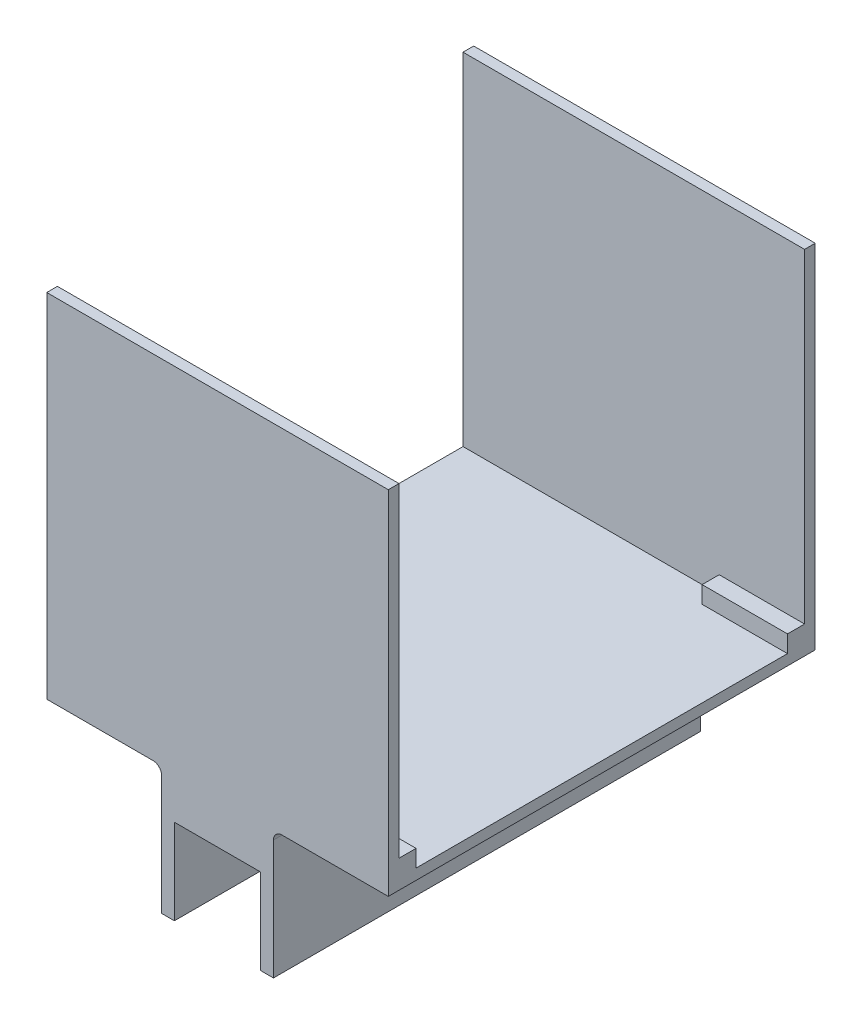
ISO-10303-21;
HEADER;
FILE_DESCRIPTION(('STEP AP214'),'2;1');
FILE_NAME('part.step','',(''),(''),'','','');
FILE_SCHEMA(('AUTOMOTIVE_DESIGN { 1 0 10303 214 1 1 1 1 }'));
ENDSEC;
DATA;
#1=APPLICATION_CONTEXT('core data for automotive mechanical design processes');
#2=APPLICATION_PROTOCOL_DEFINITION('international standard','automotive_design',2000,#1);
#3=PRODUCT_CONTEXT('',#1,'mechanical');
#4=PRODUCT('Part','Part','',(#3));
#5=PRODUCT_RELATED_PRODUCT_CATEGORY('part','',(#4));
#6=PRODUCT_DEFINITION_FORMATION('','',#4);
#7=PRODUCT_DEFINITION_CONTEXT('part definition',#1,'design');
#8=PRODUCT_DEFINITION('design','',#6,#7);
#9=PRODUCT_DEFINITION_SHAPE('','',#8);
#10=(LENGTH_UNIT() NAMED_UNIT(*) SI_UNIT(.MILLI.,.METRE.));
#11=(NAMED_UNIT(*) PLANE_ANGLE_UNIT() SI_UNIT($,.RADIAN.));
#12=(NAMED_UNIT(*) SI_UNIT($,.STERADIAN.) SOLID_ANGLE_UNIT());
#13=UNCERTAINTY_MEASURE_WITH_UNIT(LENGTH_MEASURE(1.E-05),#10,'distance_accuracy_value','');
#14=(GEOMETRIC_REPRESENTATION_CONTEXT(3) GLOBAL_UNCERTAINTY_ASSIGNED_CONTEXT((#13)) GLOBAL_UNIT_ASSIGNED_CONTEXT((#10,
#11,#12)) REPRESENTATION_CONTEXT('',''));
#15=CARTESIAN_POINT('',(0.,0.,0.));
#16=DIRECTION('',(0.,0.,1.));
#17=DIRECTION('',(1.,0.,0.));
#18=AXIS2_PLACEMENT_3D('',#15,#16,#17);
#19=CARTESIAN_POINT('',(0.,28.575,0.));
#20=DIRECTION('',(0.,-1.,0.));
#21=DIRECTION('',(0.,0.,-1.));
#22=AXIS2_PLACEMENT_3D('',#19,#20,#21);
#23=PLANE('',#22);
#24=DIRECTION('',(0.,0.,1.));
#25=VECTOR('',#24,1.);
#26=CARTESIAN_POINT('',(50.546,28.575,4.50850000000001));
#27=LINE('',#26,#25);
#28=CARTESIAN_POINT('',(50.546,28.575,3.17500000000001));
#29=VERTEX_POINT('',#28);
#30=CARTESIAN_POINT('',(50.546,28.575,4.50850000000001));
#31=VERTEX_POINT('',#30);
#32=EDGE_CURVE('E61',#29,#31,#27,.T.);
#33=ORIENTED_EDGE('',*,*,#32,.F.);
#34=DIRECTION('',(1.,0.,0.));
#35=VECTOR('',#34,1.);
#36=CARTESIAN_POINT('',(-50.8,28.575,3.17500000000001));
#37=LINE('',#36,#35);
#38=CARTESIAN_POINT('',(-50.8,28.575,3.17500000000001));
#39=VERTEX_POINT('',#38);
#40=EDGE_CURVE('E245',#39,#29,#37,.T.);
#41=ORIENTED_EDGE('',*,*,#40,.F.);
#42=DIRECTION('',(0.,0.,1.));
#43=VECTOR('',#42,1.);
#44=CARTESIAN_POINT('',(-50.8,28.575,127.));
#45=LINE('',#44,#43);
#46=CARTESIAN_POINT('',(-50.8,28.575,123.825));
#47=VERTEX_POINT('',#46);
#48=EDGE_CURVE('E395',#39,#47,#45,.T.);
#49=ORIENTED_EDGE('',*,*,#48,.T.);
#50=DIRECTION('',(-1.,0.,0.));
#51=VECTOR('',#50,1.);
#52=CARTESIAN_POINT('',(-50.8,28.575,123.825));
#53=LINE('',#52,#51);
#54=CARTESIAN_POINT('',(50.546,28.575,123.825));
#55=VERTEX_POINT('',#54);
#56=EDGE_CURVE('E355',#55,#47,#53,.T.);
#57=ORIENTED_EDGE('',*,*,#56,.F.);
#58=DIRECTION('',(0.,0.,-1.));
#59=VECTOR('',#58,1.);
#60=CARTESIAN_POINT('',(50.546,28.575,123.825));
#61=LINE('',#60,#59);
#62=CARTESIAN_POINT('',(50.546,28.575,122.4915));
#63=VERTEX_POINT('',#62);
#64=EDGE_CURVE('E296',#55,#63,#61,.T.);
#65=ORIENTED_EDGE('',*,*,#64,.T.);
#66=DIRECTION('',(1.,0.,0.));
#67=VECTOR('',#66,1.);
#68=CARTESIAN_POINT('',(25.4,28.575,122.4915));
#69=LINE('',#68,#67);
#70=CARTESIAN_POINT('',(25.4,28.575,122.4915));
#71=VERTEX_POINT('',#70);
#72=EDGE_CURVE('E313',#71,#63,#69,.T.);
#73=ORIENTED_EDGE('',*,*,#72,.F.);
#74=DIRECTION('',(0.,0.,1.));
#75=VECTOR('',#74,1.);
#76=CARTESIAN_POINT('',(25.4,28.575,0.));
#77=LINE('',#76,#75);
#78=CARTESIAN_POINT('',(25.4,28.575,118.745));
#79=VERTEX_POINT('',#78);
#80=EDGE_CURVE('E341',#79,#71,#77,.T.);
#81=ORIENTED_EDGE('',*,*,#80,.F.);
#82=DIRECTION('',(1.,0.,0.));
#83=VECTOR('',#82,1.);
#84=CARTESIAN_POINT('',(25.4,28.575,118.745));
#85=LINE('',#84,#83);
#86=CARTESIAN_POINT('',(50.8,28.575,118.745));
#87=VERTEX_POINT('',#86);
#88=EDGE_CURVE('E328',#79,#87,#85,.T.);
#89=ORIENTED_EDGE('',*,*,#88,.T.);
#90=DIRECTION('',(0.,0.,-1.));
#91=VECTOR('',#90,1.);
#92=CARTESIAN_POINT('',(50.8,28.575,127.));
#93=LINE('',#92,#91);
#94=CARTESIAN_POINT('',(50.8,28.575,8.25500000000001));
#95=VERTEX_POINT('',#94);
#96=EDGE_CURVE('E392',#87,#95,#93,.T.);
#97=ORIENTED_EDGE('',*,*,#96,.T.);
#98=DIRECTION('',(1.,0.,0.));
#99=VECTOR('',#98,1.);
#100=CARTESIAN_POINT('',(18.2157951031447,28.575,8.25500000000001));
#101=LINE('',#100,#99);
#102=CARTESIAN_POINT('',(25.4,28.575,8.25500000000001));
#103=VERTEX_POINT('',#102);
#104=EDGE_CURVE('E280',#103,#95,#101,.T.);
#105=ORIENTED_EDGE('',*,*,#104,.F.);
#106=DIRECTION('',(0.,0.,-1.));
#107=VECTOR('',#106,1.);
#108=CARTESIAN_POINT('',(25.4,28.575,0.));
#109=LINE('',#108,#107);
#110=CARTESIAN_POINT('',(25.4,28.575,4.50850000000001));
#111=VERTEX_POINT('',#110);
#112=EDGE_CURVE('E265',#103,#111,#109,.T.);
#113=ORIENTED_EDGE('',*,*,#112,.T.);
#114=DIRECTION('',(1.,0.,0.));
#115=VECTOR('',#114,1.);
#116=CARTESIAN_POINT('',(18.2157951031447,28.575,4.50850000000001));
#117=LINE('',#116,#115);
#118=EDGE_CURVE('E277',#111,#31,#117,.T.);
#119=ORIENTED_EDGE('',*,*,#118,.T.);
#120=EDGE_LOOP('',(#33,#41,#49,#57,#65,#73,#81,#89,#97,#105,#113,#119));
#121=FACE_BOUND('',#120,.T.);
#122=ADVANCED_FACE('F45',(#121),#23,.F.);
#123=CARTESIAN_POINT('',(-50.8,130.175,3.17500000000001));
#124=DIRECTION('',(0.,0.,-1.));
#125=DIRECTION('',(-1.,0.,0.));
#126=AXIS2_PLACEMENT_3D('',#123,#124,#125);
#127=PLANE('',#126);
#128=DIRECTION('',(0.,-1.,0.));
#129=VECTOR('',#128,1.);
#130=CARTESIAN_POINT('',(50.546,29.9085,3.17500000000001));
#131=LINE('',#130,#129);
#132=CARTESIAN_POINT('',(50.546,29.9085,3.17500000000001));
#133=VERTEX_POINT('',#132);
#134=EDGE_CURVE('E242',#133,#29,#131,.T.);
#135=ORIENTED_EDGE('',*,*,#134,.F.);
#136=DIRECTION('',(1.,0.,0.));
#137=VECTOR('',#136,1.);
#138=CARTESIAN_POINT('',(18.2157951031447,29.9085,3.17500000000001));
#139=LINE('',#138,#137);
#140=CARTESIAN_POINT('',(25.4,29.9085,3.17500000000001));
#141=VERTEX_POINT('',#140);
#142=EDGE_CURVE('E230',#141,#133,#139,.T.);
#143=ORIENTED_EDGE('',*,*,#142,.F.);
#144=DIRECTION('',(0.,1.,0.));
#145=VECTOR('',#144,1.);
#146=CARTESIAN_POINT('',(25.4,0.,3.17500000000001));
#147=LINE('',#146,#145);
#148=CARTESIAN_POINT('',(25.4,33.655,3.17500000000001));
#149=VERTEX_POINT('',#148);
#150=EDGE_CURVE('E261',#141,#149,#147,.T.);
#151=ORIENTED_EDGE('',*,*,#150,.T.);
#152=DIRECTION('',(1.,0.,0.));
#153=VECTOR('',#152,1.);
#154=CARTESIAN_POINT('',(18.2157951031447,33.655,3.17500000000001));
#155=LINE('',#154,#153);
#156=CARTESIAN_POINT('',(50.8,33.655,3.17500000000001));
#157=VERTEX_POINT('',#156);
#158=EDGE_CURVE('E238',#149,#157,#155,.T.);
#159=ORIENTED_EDGE('',*,*,#158,.T.);
#160=DIRECTION('',(0.,-1.,0.));
#161=VECTOR('',#160,1.);
#162=CARTESIAN_POINT('',(50.8,130.175,3.17500000000001));
#163=LINE('',#162,#161);
#164=CARTESIAN_POINT('',(50.8,130.175,3.17500000000001));
#165=VERTEX_POINT('',#164);
#166=EDGE_CURVE('E348',#165,#157,#163,.T.);
#167=ORIENTED_EDGE('',*,*,#166,.F.);
#168=DIRECTION('',(1.,0.,0.));
#169=VECTOR('',#168,1.);
#170=CARTESIAN_POINT('',(-50.8,130.175,3.17500000000001));
#171=LINE('',#170,#169);
#172=CARTESIAN_POINT('',(-50.8,130.175,3.17500000000001));
#173=VERTEX_POINT('',#172);
#174=EDGE_CURVE('E363',#173,#165,#171,.T.);
#175=ORIENTED_EDGE('',*,*,#174,.F.);
#176=DIRECTION('',(0.,-1.,0.));
#177=VECTOR('',#176,1.);
#178=CARTESIAN_POINT('',(-50.8,130.175,3.17500000000001));
#179=LINE('',#178,#177);
#180=EDGE_CURVE('E345',#173,#39,#179,.T.);
#181=ORIENTED_EDGE('',*,*,#180,.T.);
#182=ORIENTED_EDGE('',*,*,#40,.T.);
#183=EDGE_LOOP('',(#135,#143,#151,#159,#167,#175,#181,#182));
#184=FACE_BOUND('',#183,.T.);
#185=ADVANCED_FACE('F243',(#184),#127,.F.);
#186=CARTESIAN_POINT('',(18.2157951031447,29.9085,4.50850000000001));
#187=DIRECTION('',(1.,0.,0.));
#188=DIRECTION('',(0.,0.,-1.));
#189=AXIS2_PLACEMENT_3D('',#186,#187,#188);
#190=CYLINDRICAL_SURFACE('',#189,1.3335);
#191=CARTESIAN_POINT('',(50.546,29.9085,4.50850000000001));
#192=DIRECTION('',(1.,0.,0.));
#193=DIRECTION('',(0.,0.,-1.));
#194=AXIS2_PLACEMENT_3D('',#191,#192,#193);
#195=CIRCLE('',#194,1.3335);
#196=EDGE_CURVE('E69',#31,#133,#195,.F.);
#197=ORIENTED_EDGE('',*,*,#196,.F.);
#198=ORIENTED_EDGE('',*,*,#118,.F.);
#199=CARTESIAN_POINT('',(25.4,29.9085,4.50850000000001));
#200=DIRECTION('',(1.,0.,0.));
#201=DIRECTION('',(0.,0.,-1.));
#202=AXIS2_PLACEMENT_3D('',#199,#200,#201);
#203=CIRCLE('',#202,1.3335);
#204=EDGE_CURVE('E234',#111,#141,#203,.F.);
#205=ORIENTED_EDGE('',*,*,#204,.T.);
#206=ORIENTED_EDGE('',*,*,#142,.T.);
#207=EDGE_LOOP('',(#197,#198,#205,#206));
#208=FACE_BOUND('',#207,.T.);
#209=ADVANCED_FACE('F232',(#208),#190,.F.);
#210=CARTESIAN_POINT('',(-50.8,130.175,123.825));
#211=DIRECTION('',(0.,0.,1.));
#212=DIRECTION('',(1.,0.,0.));
#213=AXIS2_PLACEMENT_3D('',#210,#211,#212);
#214=PLANE('',#213);
#215=DIRECTION('',(0.,-1.,0.));
#216=VECTOR('',#215,1.);
#217=CARTESIAN_POINT('',(50.546,29.9085,123.825));
#218=LINE('',#217,#216);
#219=CARTESIAN_POINT('',(50.546,29.9085,123.825));
#220=VERTEX_POINT('',#219);
#221=EDGE_CURVE('E293',#220,#55,#218,.T.);
#222=ORIENTED_EDGE('',*,*,#221,.T.);
#223=ORIENTED_EDGE('',*,*,#56,.T.);
#224=DIRECTION('',(0.,-1.,0.));
#225=VECTOR('',#224,1.);
#226=CARTESIAN_POINT('',(-50.8,130.175,123.825));
#227=LINE('',#226,#225);
#228=CARTESIAN_POINT('',(-50.8,130.175,123.825));
#229=VERTEX_POINT('',#228);
#230=EDGE_CURVE('E382',#229,#47,#227,.T.);
#231=ORIENTED_EDGE('',*,*,#230,.F.);
#232=DIRECTION('',(-1.,0.,0.));
#233=VECTOR('',#232,1.);
#234=CARTESIAN_POINT('',(-50.8,130.175,123.825));
#235=LINE('',#234,#233);
#236=CARTESIAN_POINT('',(50.8,130.175,123.825));
#237=VERTEX_POINT('',#236);
#238=EDGE_CURVE('E379',#237,#229,#235,.T.);
#239=ORIENTED_EDGE('',*,*,#238,.F.);
#240=DIRECTION('',(0.,-1.,0.));
#241=VECTOR('',#240,1.);
#242=CARTESIAN_POINT('',(50.8,130.175,123.825));
#243=LINE('',#242,#241);
#244=CARTESIAN_POINT('',(50.8,33.655,123.825));
#245=VERTEX_POINT('',#244);
#246=EDGE_CURVE('E388',#237,#245,#243,.T.);
#247=ORIENTED_EDGE('',*,*,#246,.T.);
#248=DIRECTION('',(1.,0.,0.));
#249=VECTOR('',#248,1.);
#250=CARTESIAN_POINT('',(25.4,33.655,123.825));
#251=LINE('',#250,#249);
#252=CARTESIAN_POINT('',(25.4,33.655,123.825));
#253=VERTEX_POINT('',#252);
#254=EDGE_CURVE('E320',#253,#245,#251,.T.);
#255=ORIENTED_EDGE('',*,*,#254,.F.);
#256=DIRECTION('',(0.,1.,0.));
#257=VECTOR('',#256,1.);
#258=CARTESIAN_POINT('',(25.4,130.175,123.825));
#259=LINE('',#258,#257);
#260=CARTESIAN_POINT('',(25.4,29.9085,123.825));
#261=VERTEX_POINT('',#260);
#262=EDGE_CURVE('E324',#261,#253,#259,.T.);
#263=ORIENTED_EDGE('',*,*,#262,.F.);
#264=DIRECTION('',(1.,0.,0.));
#265=VECTOR('',#264,1.);
#266=CARTESIAN_POINT('',(25.4,29.9085,123.825));
#267=LINE('',#266,#265);
#268=EDGE_CURVE('E332',#261,#220,#267,.T.);
#269=ORIENTED_EDGE('',*,*,#268,.T.);
#270=EDGE_LOOP('',(#222,#223,#231,#239,#247,#255,#263,#269));
#271=FACE_BOUND('',#270,.T.);
#272=ADVANCED_FACE('F618',(#271),#214,.F.);
#273=CARTESIAN_POINT('',(25.4,29.9085,122.4915));
#274=DIRECTION('',(1.,0.,0.));
#275=DIRECTION('',(0.,0.,-1.));
#276=AXIS2_PLACEMENT_3D('',#273,#274,#275);
#277=CYLINDRICAL_SURFACE('',#276,1.3335);
#278=CARTESIAN_POINT('',(50.546,29.9085,122.4915));
#279=DIRECTION('',(1.,0.,0.));
#280=DIRECTION('',(0.,0.,-1.));
#281=AXIS2_PLACEMENT_3D('',#278,#279,#280);
#282=CIRCLE('',#281,1.3335);
#283=EDGE_CURVE('E270',#63,#220,#282,.T.);
#284=ORIENTED_EDGE('',*,*,#283,.T.);
#285=ORIENTED_EDGE('',*,*,#268,.F.);
#286=CARTESIAN_POINT('',(25.4,29.9085,122.4915));
#287=DIRECTION('',(1.,0.,0.));
#288=DIRECTION('',(0.,0.,-1.));
#289=AXIS2_PLACEMENT_3D('',#286,#287,#288);
#290=CIRCLE('',#289,1.3335);
#291=EDGE_CURVE('E301',#71,#261,#290,.T.);
#292=ORIENTED_EDGE('',*,*,#291,.F.);
#293=ORIENTED_EDGE('',*,*,#72,.T.);
#294=EDGE_LOOP('',(#284,#285,#292,#293));
#295=FACE_BOUND('',#294,.T.);
#296=ADVANCED_FACE('F627',(#295),#277,.F.);
#297=CARTESIAN_POINT('',(12.827,-12.7,127.));
#298=DIRECTION('',(1.,0.,0.));
#299=DIRECTION('',(0.,0.,-1.));
#300=AXIS2_PLACEMENT_3D('',#297,#298,#299);
#301=PLANE('',#300);
#302=DIRECTION('',(0.,-1.,0.));
#303=VECTOR('',#302,1.);
#304=CARTESIAN_POINT('',(12.827,-12.7,0.));
#305=LINE('',#304,#303);
#306=CARTESIAN_POINT('',(12.827,12.7,0.));
#307=VERTEX_POINT('',#306);
#308=CARTESIAN_POINT('',(12.827,-12.7,0.));
#309=VERTEX_POINT('',#308);
#310=EDGE_CURVE('E430',#307,#309,#305,.T.);
#311=ORIENTED_EDGE('',*,*,#310,.T.);
#312=DIRECTION('',(0.,0.,-1.));
#313=VECTOR('',#312,1.);
#314=CARTESIAN_POINT('',(12.827,-12.7,127.));
#315=LINE('',#314,#313);
#316=CARTESIAN_POINT('',(12.827,-12.7,127.));
#317=VERTEX_POINT('',#316);
#318=EDGE_CURVE('E496',#317,#309,#315,.T.);
#319=ORIENTED_EDGE('',*,*,#318,.F.);
#320=DIRECTION('',(0.,-1.,0.));
#321=VECTOR('',#320,1.);
#322=CARTESIAN_POINT('',(12.827,-12.7,127.));
#323=LINE('',#322,#321);
#324=CARTESIAN_POINT('',(12.827,12.7,127.));
#325=VERTEX_POINT('',#324);
#326=EDGE_CURVE('E431',#325,#317,#323,.T.);
#327=ORIENTED_EDGE('',*,*,#326,.F.);
#328=DIRECTION('',(0.,0.,-1.));
#329=VECTOR('',#328,1.);
#330=CARTESIAN_POINT('',(12.827,12.7,127.));
#331=LINE('',#330,#329);
#332=EDGE_CURVE('E455',#325,#307,#331,.T.);
#333=ORIENTED_EDGE('',*,*,#332,.T.);
#334=EDGE_LOOP('',(#311,#319,#327,#333));
#335=FACE_BOUND('',#334,.T.);
#336=ADVANCED_FACE('F560',(#335),#301,.F.);
#337=CARTESIAN_POINT('',(12.827,-12.7,127.));
#338=DIRECTION('',(0.,1.,0.));
#339=DIRECTION('',(0.,0.,1.));
#340=AXIS2_PLACEMENT_3D('',#337,#338,#339);
#341=PLANE('',#340);
#342=DIRECTION('',(1.,0.,0.));
#343=VECTOR('',#342,1.);
#344=CARTESIAN_POINT('',(12.827,-12.7,0.));
#345=LINE('',#344,#343);
#346=CARTESIAN_POINT('',(16.637,-12.7,0.));
#347=VERTEX_POINT('',#346);
#348=EDGE_CURVE('E459',#309,#347,#345,.T.);
#349=ORIENTED_EDGE('',*,*,#348,.T.);
#350=DIRECTION('',(0.,0.,-1.));
#351=VECTOR('',#350,1.);
#352=CARTESIAN_POINT('',(16.637,-12.7,127.));
#353=LINE('',#352,#351);
#354=CARTESIAN_POINT('',(16.637,-12.7,127.));
#355=VERTEX_POINT('',#354);
#356=EDGE_CURVE('E492',#355,#347,#353,.T.);
#357=ORIENTED_EDGE('',*,*,#356,.F.);
#358=DIRECTION('',(1.,0.,0.));
#359=VECTOR('',#358,1.);
#360=CARTESIAN_POINT('',(12.827,-12.7,127.));
#361=LINE('',#360,#359);
#362=EDGE_CURVE('E435',#317,#355,#361,.T.);
#363=ORIENTED_EDGE('',*,*,#362,.F.);
#364=ORIENTED_EDGE('',*,*,#318,.T.);
#365=EDGE_LOOP('',(#349,#357,#363,#364));
#366=FACE_BOUND('',#365,.T.);
#367=ADVANCED_FACE('F565',(#366),#341,.F.);
#368=CARTESIAN_POINT('',(16.637,25.4,127.));
#369=DIRECTION('',(-1.,0.,0.));
#370=DIRECTION('',(0.,-1.,0.));
#371=AXIS2_PLACEMENT_3D('',#368,#369,#370);
#372=PLANE('',#371);
#373=DIRECTION('',(0.,1.,0.));
#374=VECTOR('',#373,1.);
#375=CARTESIAN_POINT('',(16.637,25.4,0.));
#376=LINE('',#375,#374);
#377=CARTESIAN_POINT('',(16.637,22.86,0.));
#378=VERTEX_POINT('',#377);
#379=EDGE_CURVE('E462',#347,#378,#376,.T.);
#380=ORIENTED_EDGE('',*,*,#379,.T.);
#381=DIRECTION('',(0.,0.,-1.));
#382=VECTOR('',#381,1.);
#383=CARTESIAN_POINT('',(16.637,22.86,127.));
#384=LINE('',#383,#382);
#385=CARTESIAN_POINT('',(16.637,22.86,127.));
#386=VERTEX_POINT('',#385);
#387=EDGE_CURVE('E504',#378,#386,#384,.F.);
#388=ORIENTED_EDGE('',*,*,#387,.T.);
#389=DIRECTION('',(0.,1.,0.));
#390=VECTOR('',#389,1.);
#391=CARTESIAN_POINT('',(16.637,25.4,127.));
#392=LINE('',#391,#390);
#393=EDGE_CURVE('E439',#355,#386,#392,.T.);
#394=ORIENTED_EDGE('',*,*,#393,.F.);
#395=ORIENTED_EDGE('',*,*,#356,.T.);
#396=EDGE_LOOP('',(#380,#388,#394,#395));
#397=FACE_BOUND('',#396,.T.);
#398=ADVANCED_FACE('F568',(#397),#372,.F.);
#399=CARTESIAN_POINT('',(-16.637,-12.7,127.));
#400=DIRECTION('',(1.,0.,0.));
#401=DIRECTION('',(0.,0.,-1.));
#402=AXIS2_PLACEMENT_3D('',#399,#400,#401);
#403=PLANE('',#402);
#404=DIRECTION('',(0.,-1.,0.));
#405=VECTOR('',#404,1.);
#406=CARTESIAN_POINT('',(-16.637,-12.7,127.));
#407=LINE('',#406,#405);
#408=CARTESIAN_POINT('',(-16.637,22.86,127.));
#409=VERTEX_POINT('',#408);
#410=CARTESIAN_POINT('',(-16.637,-12.7,127.));
#411=VERTEX_POINT('',#410);
#412=EDGE_CURVE('E443',#409,#411,#407,.T.);
#413=ORIENTED_EDGE('',*,*,#412,.F.);
#414=DIRECTION('',(0.,0.,-1.));
#415=VECTOR('',#414,1.);
#416=CARTESIAN_POINT('',(-16.637,22.86,127.));
#417=LINE('',#416,#415);
#418=CARTESIAN_POINT('',(-16.637,22.86,0.));
#419=VERTEX_POINT('',#418);
#420=EDGE_CURVE('E507',#409,#419,#417,.T.);
#421=ORIENTED_EDGE('',*,*,#420,.T.);
#422=DIRECTION('',(0.,-1.,0.));
#423=VECTOR('',#422,1.);
#424=CARTESIAN_POINT('',(-16.637,-12.7,0.));
#425=LINE('',#424,#423);
#426=CARTESIAN_POINT('',(-16.637,-12.7,0.));
#427=VERTEX_POINT('',#426);
#428=EDGE_CURVE('E466',#419,#427,#425,.T.);
#429=ORIENTED_EDGE('',*,*,#428,.T.);
#430=DIRECTION('',(0.,0.,-1.));
#431=VECTOR('',#430,1.);
#432=CARTESIAN_POINT('',(-16.637,-12.7,127.));
#433=LINE('',#432,#431);
#434=EDGE_CURVE('E488',#411,#427,#433,.T.);
#435=ORIENTED_EDGE('',*,*,#434,.F.);
#436=EDGE_LOOP('',(#413,#421,#429,#435));
#437=FACE_BOUND('',#436,.T.);
#438=ADVANCED_FACE('F541',(#437),#403,.F.);
#439=CARTESIAN_POINT('',(-12.827,-12.7,127.));
#440=DIRECTION('',(0.,1.,0.));
#441=DIRECTION('',(0.,0.,1.));
#442=AXIS2_PLACEMENT_3D('',#439,#440,#441);
#443=PLANE('',#442);
#444=DIRECTION('',(1.,0.,0.));
#445=VECTOR('',#444,1.);
#446=CARTESIAN_POINT('',(-12.827,-12.7,0.));
#447=LINE('',#446,#445);
#448=CARTESIAN_POINT('',(-12.827,-12.7,0.));
#449=VERTEX_POINT('',#448);
#450=EDGE_CURVE('E469',#427,#449,#447,.T.);
#451=ORIENTED_EDGE('',*,*,#450,.T.);
#452=DIRECTION('',(0.,0.,-1.));
#453=VECTOR('',#452,1.);
#454=CARTESIAN_POINT('',(-12.827,-12.7,127.));
#455=LINE('',#454,#453);
#456=CARTESIAN_POINT('',(-12.827,-12.7,127.));
#457=VERTEX_POINT('',#456);
#458=EDGE_CURVE('E484',#457,#449,#455,.T.);
#459=ORIENTED_EDGE('',*,*,#458,.F.);
#460=DIRECTION('',(1.,0.,0.));
#461=VECTOR('',#460,1.);
#462=CARTESIAN_POINT('',(-12.827,-12.7,127.));
#463=LINE('',#462,#461);
#464=EDGE_CURVE('E446',#411,#457,#463,.T.);
#465=ORIENTED_EDGE('',*,*,#464,.F.);
#466=ORIENTED_EDGE('',*,*,#434,.T.);
#467=EDGE_LOOP('',(#451,#459,#465,#466));
#468=FACE_BOUND('',#467,.T.);
#469=ADVANCED_FACE('F545',(#468),#443,.F.);
#470=CARTESIAN_POINT('',(-12.827,-12.7,127.));
#471=DIRECTION('',(-1.,0.,0.));
#472=DIRECTION('',(0.,0.,1.));
#473=AXIS2_PLACEMENT_3D('',#470,#471,#472);
#474=PLANE('',#473);
#475=DIRECTION('',(0.,1.,0.));
#476=VECTOR('',#475,1.);
#477=CARTESIAN_POINT('',(-12.827,-12.7,0.));
#478=LINE('',#477,#476);
#479=CARTESIAN_POINT('',(-12.827,12.7,0.));
#480=VERTEX_POINT('',#479);
#481=EDGE_CURVE('E472',#449,#480,#478,.T.);
#482=ORIENTED_EDGE('',*,*,#481,.T.);
#483=DIRECTION('',(0.,0.,-1.));
#484=VECTOR('',#483,1.);
#485=CARTESIAN_POINT('',(-12.827,12.7,127.));
#486=LINE('',#485,#484);
#487=CARTESIAN_POINT('',(-12.827,12.7,127.));
#488=VERTEX_POINT('',#487);
#489=EDGE_CURVE('E480',#488,#480,#486,.T.);
#490=ORIENTED_EDGE('',*,*,#489,.F.);
#491=DIRECTION('',(0.,1.,0.));
#492=VECTOR('',#491,1.);
#493=CARTESIAN_POINT('',(-12.827,-12.7,127.));
#494=LINE('',#493,#492);
#495=EDGE_CURVE('E449',#457,#488,#494,.T.);
#496=ORIENTED_EDGE('',*,*,#495,.F.);
#497=ORIENTED_EDGE('',*,*,#458,.T.);
#498=EDGE_LOOP('',(#482,#490,#496,#497));
#499=FACE_BOUND('',#498,.T.);
#500=ADVANCED_FACE('F551',(#499),#474,.F.);
#501=CARTESIAN_POINT('',(-12.827,12.7,127.));
#502=DIRECTION('',(0.,1.,0.));
#503=DIRECTION('',(0.,0.,1.));
#504=AXIS2_PLACEMENT_3D('',#501,#502,#503);
#505=PLANE('',#504);
#506=DIRECTION('',(1.,0.,0.));
#507=VECTOR('',#506,1.);
#508=CARTESIAN_POINT('',(-12.827,12.7,0.));
#509=LINE('',#508,#507);
#510=EDGE_CURVE('E436',#480,#307,#509,.T.);
#511=ORIENTED_EDGE('',*,*,#510,.T.);
#512=ORIENTED_EDGE('',*,*,#332,.F.);
#513=DIRECTION('',(1.,0.,0.));
#514=VECTOR('',#513,1.);
#515=CARTESIAN_POINT('',(-12.827,12.7,127.));
#516=LINE('',#515,#514);
#517=EDGE_CURVE('E452',#488,#325,#516,.T.);
#518=ORIENTED_EDGE('',*,*,#517,.F.);
#519=ORIENTED_EDGE('',*,*,#489,.T.);
#520=EDGE_LOOP('',(#511,#512,#518,#519));
#521=FACE_BOUND('',#520,.T.);
#522=ADVANCED_FACE('F555',(#521),#505,.F.);
#523=CARTESIAN_POINT('',(0.,0.,127.));
#524=DIRECTION('',(0.,0.,-1.));
#525=DIRECTION('',(-1.,0.,0.));
#526=AXIS2_PLACEMENT_3D('',#523,#524,#525);
#527=PLANE('',#526);
#528=DIRECTION('',(0.,-1.,0.));
#529=VECTOR('',#528,1.);
#530=CARTESIAN_POINT('',(50.8,28.575,127.));
#531=LINE('',#530,#529);
#532=CARTESIAN_POINT('',(50.8,130.175,127.));
#533=VERTEX_POINT('',#532);
#534=CARTESIAN_POINT('',(50.8,25.4,127.));
#535=VERTEX_POINT('',#534);
#536=EDGE_CURVE('E400',#533,#535,#531,.T.);
#537=ORIENTED_EDGE('',*,*,#536,.F.);
#538=DIRECTION('',(1.,0.,0.));
#539=VECTOR('',#538,1.);
#540=CARTESIAN_POINT('',(-50.8,130.175,127.));
#541=LINE('',#540,#539);
#542=CARTESIAN_POINT('',(-50.8,130.175,127.));
#543=VERTEX_POINT('',#542);
#544=EDGE_CURVE('E373',#543,#533,#541,.T.);
#545=ORIENTED_EDGE('',*,*,#544,.F.);
#546=DIRECTION('',(0.,-1.,0.));
#547=VECTOR('',#546,1.);
#548=CARTESIAN_POINT('',(-50.8,28.575,127.));
#549=LINE('',#548,#547);
#550=CARTESIAN_POINT('',(-50.8,25.4,127.));
#551=VERTEX_POINT('',#550);
#552=EDGE_CURVE('E418',#543,#551,#549,.T.);
#553=ORIENTED_EDGE('',*,*,#552,.T.);
#554=DIRECTION('',(1.,0.,0.));
#555=VECTOR('',#554,1.);
#556=CARTESIAN_POINT('',(-50.8,25.4,127.));
#557=LINE('',#556,#555);
#558=CARTESIAN_POINT('',(-19.177,25.4,127.));
#559=VERTEX_POINT('',#558);
#560=EDGE_CURVE('E396',#551,#559,#557,.T.);
#561=ORIENTED_EDGE('',*,*,#560,.T.);
#562=CARTESIAN_POINT('',(-19.177,22.86,127.));
#563=DIRECTION('',(0.,0.,-1.));
#564=DIRECTION('',(-1.,0.,0.));
#565=AXIS2_PLACEMENT_3D('',#562,#563,#564);
#566=CIRCLE('',#565,2.54);
#567=EDGE_CURVE('E11',#559,#409,#566,.T.);
#568=ORIENTED_EDGE('',*,*,#567,.T.);
#569=ORIENTED_EDGE('',*,*,#412,.T.);
#570=ORIENTED_EDGE('',*,*,#464,.T.);
#571=ORIENTED_EDGE('',*,*,#495,.T.);
#572=ORIENTED_EDGE('',*,*,#517,.T.);
#573=ORIENTED_EDGE('',*,*,#326,.T.);
#574=ORIENTED_EDGE('',*,*,#362,.T.);
#575=ORIENTED_EDGE('',*,*,#393,.T.);
#576=CARTESIAN_POINT('',(19.177,22.86,127.));
#577=DIRECTION('',(0.,0.,-1.));
#578=DIRECTION('',(-1.,0.,0.));
#579=AXIS2_PLACEMENT_3D('',#576,#577,#578);
#580=CIRCLE('',#579,2.54);
#581=CARTESIAN_POINT('',(19.177,25.4,127.));
#582=VERTEX_POINT('',#581);
#583=EDGE_CURVE('E517',#386,#582,#580,.T.);
#584=ORIENTED_EDGE('',*,*,#583,.T.);
#585=EDGE_CURVE('E411',#582,#535,#557,.T.);
#586=ORIENTED_EDGE('',*,*,#585,.T.);
#587=EDGE_LOOP('',(#537,#545,#553,#561,#568,#569,#570,#571,#572,#573,#574,#575,#584,#586));
#588=FACE_BOUND('',#587,.T.);
#589=ADVANCED_FACE('F538',(#588),#527,.F.);
#590=CARTESIAN_POINT('',(0.,0.,0.));
#591=DIRECTION('',(0.,0.,-1.));
#592=DIRECTION('',(-1.,0.,0.));
#593=AXIS2_PLACEMENT_3D('',#590,#591,#592);
#594=PLANE('',#593);
#595=DIRECTION('',(-1.,0.,0.));
#596=VECTOR('',#595,1.);
#597=CARTESIAN_POINT('',(-50.8,25.4,0.));
#598=LINE('',#597,#596);
#599=CARTESIAN_POINT('',(50.8,25.4,0.));
#600=VERTEX_POINT('',#599);
#601=CARTESIAN_POINT('',(19.177,25.4,0.));
#602=VERTEX_POINT('',#601);
#603=EDGE_CURVE('E405',#600,#602,#598,.T.);
#604=ORIENTED_EDGE('',*,*,#603,.T.);
#605=CARTESIAN_POINT('',(19.177,22.86,0.));
#606=DIRECTION('',(0.,0.,-1.));
#607=DIRECTION('',(-1.,0.,0.));
#608=AXIS2_PLACEMENT_3D('',#605,#606,#607);
#609=CIRCLE('',#608,2.54);
#610=EDGE_CURVE('E514',#602,#378,#609,.F.);
#611=ORIENTED_EDGE('',*,*,#610,.T.);
#612=ORIENTED_EDGE('',*,*,#379,.F.);
#613=ORIENTED_EDGE('',*,*,#348,.F.);
#614=ORIENTED_EDGE('',*,*,#310,.F.);
#615=ORIENTED_EDGE('',*,*,#510,.F.);
#616=ORIENTED_EDGE('',*,*,#481,.F.);
#617=ORIENTED_EDGE('',*,*,#450,.F.);
#618=ORIENTED_EDGE('',*,*,#428,.F.);
#619=CARTESIAN_POINT('',(-19.177,22.86,0.));
#620=DIRECTION('',(0.,0.,-1.));
#621=DIRECTION('',(-1.,0.,0.));
#622=AXIS2_PLACEMENT_3D('',#619,#620,#621);
#623=CIRCLE('',#622,2.54);
#624=CARTESIAN_POINT('',(-19.177,25.4,0.));
#625=VERTEX_POINT('',#624);
#626=EDGE_CURVE('E54',#419,#625,#623,.F.);
#627=ORIENTED_EDGE('',*,*,#626,.T.);
#628=CARTESIAN_POINT('',(-50.8,25.4,0.));
#629=VERTEX_POINT('',#628);
#630=EDGE_CURVE('E404',#625,#629,#598,.T.);
#631=ORIENTED_EDGE('',*,*,#630,.T.);
#632=DIRECTION('',(0.,-1.,0.));
#633=VECTOR('',#632,1.);
#634=CARTESIAN_POINT('',(-50.8,28.575,0.));
#635=LINE('',#634,#633);
#636=CARTESIAN_POINT('',(-50.8,130.175,0.));
#637=VERTEX_POINT('',#636);
#638=EDGE_CURVE('E422',#637,#629,#635,.T.);
#639=ORIENTED_EDGE('',*,*,#638,.F.);
#640=DIRECTION('',(-1.,0.,0.));
#641=VECTOR('',#640,1.);
#642=CARTESIAN_POINT('',(-50.8,130.175,0.));
#643=LINE('',#642,#641);
#644=CARTESIAN_POINT('',(50.8,130.175,0.));
#645=VERTEX_POINT('',#644);
#646=EDGE_CURVE('E352',#645,#637,#643,.T.);
#647=ORIENTED_EDGE('',*,*,#646,.F.);
#648=DIRECTION('',(0.,-1.,0.));
#649=VECTOR('',#648,1.);
#650=CARTESIAN_POINT('',(50.8,28.575,0.));
#651=LINE('',#650,#649);
#652=EDGE_CURVE('E426',#645,#600,#651,.T.);
#653=ORIENTED_EDGE('',*,*,#652,.T.);
#654=EDGE_LOOP('',(#604,#611,#612,#613,#614,#615,#616,#617,#618,#627,#631,#639,#647,#653));
#655=FACE_BOUND('',#654,.T.);
#656=ADVANCED_FACE('F523',(#655),#594,.T.);
#657=CARTESIAN_POINT('',(0.,25.4,0.));
#658=DIRECTION('',(0.,-1.,0.));
#659=DIRECTION('',(0.,0.,-1.));
#660=AXIS2_PLACEMENT_3D('',#657,#658,#659);
#661=PLANE('',#660);
#662=ORIENTED_EDGE('',*,*,#630,.F.);
#663=DIRECTION('',(0.,0.,-1.));
#664=VECTOR('',#663,1.);
#665=CARTESIAN_POINT('',(-19.177,25.4,0.));
#666=LINE('',#665,#664);
#667=EDGE_CURVE('E511',#625,#559,#666,.F.);
#668=ORIENTED_EDGE('',*,*,#667,.T.);
#669=ORIENTED_EDGE('',*,*,#560,.F.);
#670=DIRECTION('',(0.,0.,1.));
#671=VECTOR('',#670,1.);
#672=CARTESIAN_POINT('',(-50.8,25.4,127.));
#673=LINE('',#672,#671);
#674=EDGE_CURVE('E408',#629,#551,#673,.T.);
#675=ORIENTED_EDGE('',*,*,#674,.F.);
#676=EDGE_LOOP('',(#662,#668,#669,#675));
#677=FACE_BOUND('',#676,.T.);
#678=ADVANCED_FACE('F531',(#677),#661,.T.);
#679=CARTESIAN_POINT('',(50.8,28.575,127.));
#680=DIRECTION('',(-1.,0.,0.));
#681=DIRECTION('',(0.,0.,1.));
#682=AXIS2_PLACEMENT_3D('',#679,#680,#681);
#683=PLANE('',#682);
#684=DIRECTION('',(0.,1.,0.));
#685=VECTOR('',#684,1.);
#686=CARTESIAN_POINT('',(50.8,0.,8.25500000000001));
#687=LINE('',#686,#685);
#688=CARTESIAN_POINT('',(50.8,33.655,8.25500000000001));
#689=VERTEX_POINT('',#688);
#690=EDGE_CURVE('E239',#95,#689,#687,.T.);
#691=ORIENTED_EDGE('',*,*,#690,.F.);
#692=ORIENTED_EDGE('',*,*,#96,.F.);
#693=DIRECTION('',(0.,1.,0.));
#694=VECTOR('',#693,1.);
#695=CARTESIAN_POINT('',(50.8,0.,118.745));
#696=LINE('',#695,#694);
#697=CARTESIAN_POINT('',(50.8,33.655,118.745));
#698=VERTEX_POINT('',#697);
#699=EDGE_CURVE('E300',#87,#698,#696,.T.);
#700=ORIENTED_EDGE('',*,*,#699,.T.);
#701=DIRECTION('',(0.,0.,-1.));
#702=VECTOR('',#701,1.);
#703=CARTESIAN_POINT('',(50.8,33.655,0.));
#704=LINE('',#703,#702);
#705=EDGE_CURVE('E306',#245,#698,#704,.T.);
#706=ORIENTED_EDGE('',*,*,#705,.F.);
#707=ORIENTED_EDGE('',*,*,#246,.F.);
#708=DIRECTION('',(0.,0.,-1.));
#709=VECTOR('',#708,1.);
#710=CARTESIAN_POINT('',(50.8,130.175,127.));
#711=LINE('',#710,#709);
#712=EDGE_CURVE('E376',#533,#237,#711,.T.);
#713=ORIENTED_EDGE('',*,*,#712,.F.);
#714=ORIENTED_EDGE('',*,*,#536,.T.);
#715=DIRECTION('',(0.,0.,-1.));
#716=VECTOR('',#715,1.);
#717=CARTESIAN_POINT('',(50.8,25.4,127.));
#718=LINE('',#717,#716);
#719=EDGE_CURVE('E391',#535,#600,#718,.T.);
#720=ORIENTED_EDGE('',*,*,#719,.T.);
#721=ORIENTED_EDGE('',*,*,#652,.F.);
#722=DIRECTION('',(0.,0.,-1.));
#723=VECTOR('',#722,1.);
#724=CARTESIAN_POINT('',(50.8,130.175,0.));
#725=LINE('',#724,#723);
#726=EDGE_CURVE('E359',#165,#645,#725,.T.);
#727=ORIENTED_EDGE('',*,*,#726,.F.);
#728=ORIENTED_EDGE('',*,*,#166,.T.);
#729=DIRECTION('',(0.,0.,1.));
#730=VECTOR('',#729,1.);
#731=CARTESIAN_POINT('',(50.8,33.655,0.));
#732=LINE('',#731,#730);
#733=EDGE_CURVE('E253',#157,#689,#732,.T.);
#734=ORIENTED_EDGE('',*,*,#733,.T.);
#735=EDGE_LOOP('',(#691,#692,#700,#706,#707,#713,#714,#720,#721,#727,#728,#734));
#736=FACE_BOUND('',#735,.T.);
#737=ADVANCED_FACE('F581',(#736),#683,.F.);
#738=CARTESIAN_POINT('',(-50.8,28.575,127.));
#739=DIRECTION('',(1.,0.,0.));
#740=DIRECTION('',(0.,0.,-1.));
#741=AXIS2_PLACEMENT_3D('',#738,#739,#740);
#742=PLANE('',#741);
#743=ORIENTED_EDGE('',*,*,#674,.T.);
#744=ORIENTED_EDGE('',*,*,#552,.F.);
#745=DIRECTION('',(0.,0.,1.));
#746=VECTOR('',#745,1.);
#747=CARTESIAN_POINT('',(-50.8,130.175,127.));
#748=LINE('',#747,#746);
#749=EDGE_CURVE('E369',#229,#543,#748,.T.);
#750=ORIENTED_EDGE('',*,*,#749,.F.);
#751=ORIENTED_EDGE('',*,*,#230,.T.);
#752=ORIENTED_EDGE('',*,*,#48,.F.);
#753=ORIENTED_EDGE('',*,*,#180,.F.);
#754=DIRECTION('',(0.,0.,1.));
#755=VECTOR('',#754,1.);
#756=CARTESIAN_POINT('',(-50.8,130.175,0.));
#757=LINE('',#756,#755);
#758=EDGE_CURVE('E356',#637,#173,#757,.T.);
#759=ORIENTED_EDGE('',*,*,#758,.F.);
#760=ORIENTED_EDGE('',*,*,#638,.T.);
#761=EDGE_LOOP('',(#743,#744,#750,#751,#752,#753,#759,#760));
#762=FACE_BOUND('',#761,.T.);
#763=ADVANCED_FACE('F592',(#762),#742,.F.);
#764=ORIENTED_EDGE('',*,*,#719,.F.);
#765=ORIENTED_EDGE('',*,*,#585,.F.);
#766=DIRECTION('',(0.,0.,-1.));
#767=VECTOR('',#766,1.);
#768=CARTESIAN_POINT('',(19.177,25.4,0.));
#769=LINE('',#768,#767);
#770=EDGE_CURVE('E500',#582,#602,#769,.T.);
#771=ORIENTED_EDGE('',*,*,#770,.T.);
#772=ORIENTED_EDGE('',*,*,#603,.F.);
#773=EDGE_LOOP('',(#764,#765,#771,#772));
#774=FACE_BOUND('',#773,.T.);
#775=ADVANCED_FACE('F577',(#774),#661,.T.);
#776=CARTESIAN_POINT('',(19.177,22.86,0.));
#777=DIRECTION('',(0.,0.,-1.));
#778=DIRECTION('',(-1.,0.,0.));
#779=AXIS2_PLACEMENT_3D('',#776,#777,#778);
#780=CYLINDRICAL_SURFACE('',#779,2.54);
#781=ORIENTED_EDGE('',*,*,#583,.F.);
#782=ORIENTED_EDGE('',*,*,#387,.F.);
#783=ORIENTED_EDGE('',*,*,#610,.F.);
#784=ORIENTED_EDGE('',*,*,#770,.F.);
#785=EDGE_LOOP('',(#781,#782,#783,#784));
#786=FACE_BOUND('',#785,.T.);
#787=ADVANCED_FACE('F572',(#786),#780,.F.);
#788=CARTESIAN_POINT('',(-19.177,22.86,127.));
#789=DIRECTION('',(0.,0.,-1.));
#790=DIRECTION('',(-1.,0.,0.));
#791=AXIS2_PLACEMENT_3D('',#788,#789,#790);
#792=CYLINDRICAL_SURFACE('',#791,2.54);
#793=ORIENTED_EDGE('',*,*,#567,.F.);
#794=ORIENTED_EDGE('',*,*,#667,.F.);
#795=ORIENTED_EDGE('',*,*,#626,.F.);
#796=ORIENTED_EDGE('',*,*,#420,.F.);
#797=EDGE_LOOP('',(#793,#794,#795,#796));
#798=FACE_BOUND('',#797,.T.);
#799=ADVANCED_FACE('F47',(#798),#792,.F.);
#800=CARTESIAN_POINT('',(0.,130.175,0.));
#801=DIRECTION('',(0.,-1.,0.));
#802=DIRECTION('',(0.,0.,-1.));
#803=AXIS2_PLACEMENT_3D('',#800,#801,#802);
#804=PLANE('',#803);
#805=ORIENTED_EDGE('',*,*,#238,.T.);
#806=ORIENTED_EDGE('',*,*,#749,.T.);
#807=ORIENTED_EDGE('',*,*,#544,.T.);
#808=ORIENTED_EDGE('',*,*,#712,.T.);
#809=EDGE_LOOP('',(#805,#806,#807,#808));
#810=FACE_BOUND('',#809,.T.);
#811=ADVANCED_FACE('F588',(#810),#804,.F.);
#812=CARTESIAN_POINT('',(0.,130.175,0.));
#813=DIRECTION('',(0.,1.,0.));
#814=DIRECTION('',(0.,0.,1.));
#815=AXIS2_PLACEMENT_3D('',#812,#813,#814);
#816=PLANE('',#815);
#817=ORIENTED_EDGE('',*,*,#646,.T.);
#818=ORIENTED_EDGE('',*,*,#758,.T.);
#819=ORIENTED_EDGE('',*,*,#174,.T.);
#820=ORIENTED_EDGE('',*,*,#726,.T.);
#821=EDGE_LOOP('',(#817,#818,#819,#820));
#822=FACE_BOUND('',#821,.T.);
#823=ADVANCED_FACE('F597',(#822),#816,.T.);
#824=CARTESIAN_POINT('',(25.4,0.,0.));
#825=DIRECTION('',(1.,0.,0.));
#826=DIRECTION('',(0.,0.,-1.));
#827=AXIS2_PLACEMENT_3D('',#824,#825,#826);
#828=PLANE('',#827);
#829=DIRECTION('',(0.,1.,0.));
#830=VECTOR('',#829,1.);
#831=CARTESIAN_POINT('',(25.4,0.,118.745));
#832=LINE('',#831,#830);
#833=CARTESIAN_POINT('',(25.4,33.655,118.745));
#834=VERTEX_POINT('',#833);
#835=EDGE_CURVE('E305',#79,#834,#832,.T.);
#836=ORIENTED_EDGE('',*,*,#835,.F.);
#837=ORIENTED_EDGE('',*,*,#80,.T.);
#838=ORIENTED_EDGE('',*,*,#291,.T.);
#839=ORIENTED_EDGE('',*,*,#262,.T.);
#840=DIRECTION('',(0.,0.,-1.));
#841=VECTOR('',#840,1.);
#842=CARTESIAN_POINT('',(25.4,33.655,0.));
#843=LINE('',#842,#841);
#844=EDGE_CURVE('E310',#253,#834,#843,.T.);
#845=ORIENTED_EDGE('',*,*,#844,.T.);
#846=EDGE_LOOP('',(#836,#837,#838,#839,#845));
#847=FACE_BOUND('',#846,.T.);
#848=ADVANCED_FACE('F630',(#847),#828,.F.);
#849=CARTESIAN_POINT('',(25.4,33.655,0.));
#850=DIRECTION('',(0.,-1.,0.));
#851=DIRECTION('',(0.,0.,-1.));
#852=AXIS2_PLACEMENT_3D('',#849,#850,#851);
#853=PLANE('',#852);
#854=ORIENTED_EDGE('',*,*,#705,.T.);
#855=DIRECTION('',(1.,0.,0.));
#856=VECTOR('',#855,1.);
#857=CARTESIAN_POINT('',(25.4,33.655,118.745));
#858=LINE('',#857,#856);
#859=EDGE_CURVE('E325',#834,#698,#858,.T.);
#860=ORIENTED_EDGE('',*,*,#859,.F.);
#861=ORIENTED_EDGE('',*,*,#844,.F.);
#862=ORIENTED_EDGE('',*,*,#254,.T.);
#863=EDGE_LOOP('',(#854,#860,#861,#862));
#864=FACE_BOUND('',#863,.T.);
#865=ADVANCED_FACE('F616',(#864),#853,.F.);
#866=CARTESIAN_POINT('',(25.4,0.,118.745));
#867=DIRECTION('',(0.,0.,-1.));
#868=DIRECTION('',(-1.,0.,0.));
#869=AXIS2_PLACEMENT_3D('',#866,#867,#868);
#870=PLANE('',#869);
#871=ORIENTED_EDGE('',*,*,#699,.F.);
#872=ORIENTED_EDGE('',*,*,#88,.F.);
#873=ORIENTED_EDGE('',*,*,#835,.T.);
#874=ORIENTED_EDGE('',*,*,#859,.T.);
#875=EDGE_LOOP('',(#871,#872,#873,#874));
#876=FACE_BOUND('',#875,.T.);
#877=ADVANCED_FACE('F612',(#876),#870,.T.);
#878=CARTESIAN_POINT('',(50.546,29.9085,122.4915));
#879=DIRECTION('',(1.,0.,0.));
#880=DIRECTION('',(0.,0.,-1.));
#881=AXIS2_PLACEMENT_3D('',#878,#879,#880);
#882=PLANE('',#881);
#883=ORIENTED_EDGE('',*,*,#283,.F.);
#884=ORIENTED_EDGE('',*,*,#64,.F.);
#885=ORIENTED_EDGE('',*,*,#221,.F.);
#886=EDGE_LOOP('',(#883,#884,#885));
#887=FACE_BOUND('',#886,.T.);
#888=ADVANCED_FACE('F624',(#887),#882,.F.);
#889=CARTESIAN_POINT('',(18.2157951031447,33.655,0.));
#890=DIRECTION('',(0.,1.,0.));
#891=DIRECTION('',(0.,0.,1.));
#892=AXIS2_PLACEMENT_3D('',#889,#890,#891);
#893=PLANE('',#892);
#894=DIRECTION('',(0.,0.,-1.));
#895=VECTOR('',#894,1.);
#896=CARTESIAN_POINT('',(25.4,33.655,0.));
#897=LINE('',#896,#895);
#898=CARTESIAN_POINT('',(25.4,33.655,8.25500000000001));
#899=VERTEX_POINT('',#898);
#900=EDGE_CURVE('E256',#899,#149,#897,.T.);
#901=ORIENTED_EDGE('',*,*,#900,.F.);
#902=DIRECTION('',(1.,0.,0.));
#903=VECTOR('',#902,1.);
#904=CARTESIAN_POINT('',(18.2157951031447,33.655,8.25500000000001));
#905=LINE('',#904,#903);
#906=EDGE_CURVE('E284',#899,#689,#905,.T.);
#907=ORIENTED_EDGE('',*,*,#906,.T.);
#908=ORIENTED_EDGE('',*,*,#733,.F.);
#909=ORIENTED_EDGE('',*,*,#158,.F.);
#910=EDGE_LOOP('',(#901,#907,#908,#909));
#911=FACE_BOUND('',#910,.T.);
#912=ADVANCED_FACE('F603',(#911),#893,.T.);
#913=CARTESIAN_POINT('',(18.2157951031447,0.,8.25500000000001));
#914=DIRECTION('',(0.,0.,-1.));
#915=DIRECTION('',(-1.,0.,0.));
#916=AXIS2_PLACEMENT_3D('',#913,#914,#915);
#917=PLANE('',#916);
#918=ORIENTED_EDGE('',*,*,#906,.F.);
#919=DIRECTION('',(0.,-1.,0.));
#920=VECTOR('',#919,1.);
#921=CARTESIAN_POINT('',(25.4,0.,8.25500000000001));
#922=LINE('',#921,#920);
#923=EDGE_CURVE('E260',#899,#103,#922,.T.);
#924=ORIENTED_EDGE('',*,*,#923,.T.);
#925=ORIENTED_EDGE('',*,*,#104,.T.);
#926=ORIENTED_EDGE('',*,*,#690,.T.);
#927=EDGE_LOOP('',(#918,#924,#925,#926));
#928=FACE_BOUND('',#927,.T.);
#929=ADVANCED_FACE('F606',(#928),#917,.F.);
#930=CARTESIAN_POINT('',(25.4,0.,0.));
#931=DIRECTION('',(1.,0.,0.));
#932=DIRECTION('',(0.,0.,-1.));
#933=AXIS2_PLACEMENT_3D('',#930,#931,#932);
#934=PLANE('',#933);
#935=ORIENTED_EDGE('',*,*,#112,.F.);
#936=ORIENTED_EDGE('',*,*,#923,.F.);
#937=ORIENTED_EDGE('',*,*,#900,.T.);
#938=ORIENTED_EDGE('',*,*,#150,.F.);
#939=ORIENTED_EDGE('',*,*,#204,.F.);
#940=EDGE_LOOP('',(#935,#936,#937,#938,#939));
#941=FACE_BOUND('',#940,.T.);
#942=ADVANCED_FACE('F697',(#941),#934,.F.);
#943=CARTESIAN_POINT('',(50.546,29.9085,122.4915));
#944=DIRECTION('',(1.,0.,0.));
#945=DIRECTION('',(0.,0.,-1.));
#946=AXIS2_PLACEMENT_3D('',#943,#944,#945);
#947=PLANE('',#946);
#948=ORIENTED_EDGE('',*,*,#196,.T.);
#949=ORIENTED_EDGE('',*,*,#134,.T.);
#950=ORIENTED_EDGE('',*,*,#32,.T.);
#951=EDGE_LOOP('',(#948,#949,#950));
#952=FACE_BOUND('',#951,.T.);
#953=ADVANCED_FACE('F249',(#952),#947,.F.);
#954=CLOSED_SHELL('',(#122,#185,#209,#272,#296,#336,#367,#398,#438,#469,#500,#522,#589,#656,
#678,#737,#763,#775,#787,#799,#811,#823,#848,#865,#877,#888,#912,#929,#942,#953));
#955=MANIFOLD_SOLID_BREP('B2',#954);
#956=ADVANCED_BREP_SHAPE_REPRESENTATION('',(#18,#955),#14);
#957=SHAPE_DEFINITION_REPRESENTATION(#9,#956);
ENDSEC;
END-ISO-10303-21;
